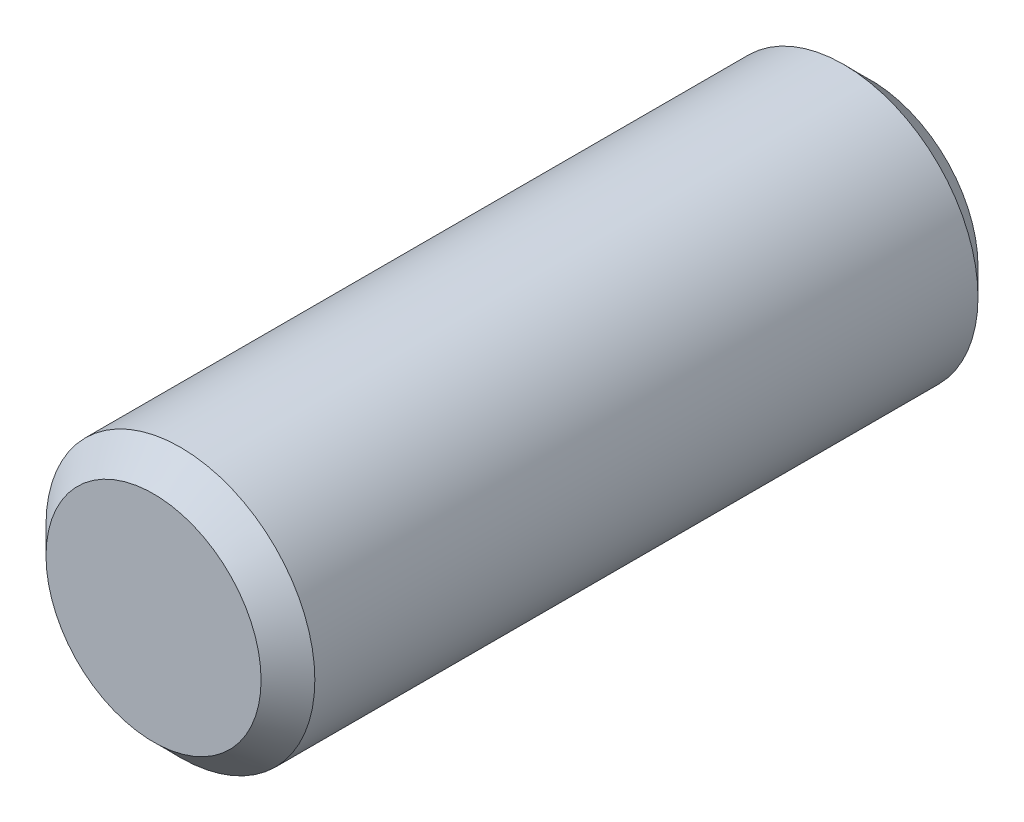
ISO-10303-21;
HEADER;
FILE_DESCRIPTION(('STEP AP214'),'2;1');
FILE_NAME('part.step','',(''),(''),'','','');
FILE_SCHEMA(('AUTOMOTIVE_DESIGN { 1 0 10303 214 1 1 1 1 }'));
ENDSEC;
DATA;
#1=APPLICATION_CONTEXT('core data for automotive mechanical design processes');
#2=APPLICATION_PROTOCOL_DEFINITION('international standard','automotive_design',2000,#1);
#3=PRODUCT_CONTEXT('',#1,'mechanical');
#4=PRODUCT('Part','Part','',(#3));
#5=PRODUCT_RELATED_PRODUCT_CATEGORY('part','',(#4));
#6=PRODUCT_DEFINITION_FORMATION('','',#4);
#7=PRODUCT_DEFINITION_CONTEXT('part definition',#1,'design');
#8=PRODUCT_DEFINITION('design','',#6,#7);
#9=PRODUCT_DEFINITION_SHAPE('','',#8);
#10=(LENGTH_UNIT() NAMED_UNIT(*) SI_UNIT(.MILLI.,.METRE.));
#11=(NAMED_UNIT(*) PLANE_ANGLE_UNIT() SI_UNIT($,.RADIAN.));
#12=(NAMED_UNIT(*) SI_UNIT($,.STERADIAN.) SOLID_ANGLE_UNIT());
#13=UNCERTAINTY_MEASURE_WITH_UNIT(LENGTH_MEASURE(1.E-05),#10,'distance_accuracy_value','');
#14=(GEOMETRIC_REPRESENTATION_CONTEXT(3) GLOBAL_UNCERTAINTY_ASSIGNED_CONTEXT((#13)) GLOBAL_UNIT_ASSIGNED_CONTEXT((#10,
#11,#12)) REPRESENTATION_CONTEXT('',''));
#15=CARTESIAN_POINT('',(0.,0.,0.));
#16=DIRECTION('',(0.,0.,1.));
#17=DIRECTION('',(1.,0.,0.));
#18=AXIS2_PLACEMENT_3D('',#15,#16,#17);
#19=CARTESIAN_POINT('',(0.,0.,8.));
#20=DIRECTION('',(0.,0.,-1.));
#21=DIRECTION('',(-1.,0.,0.));
#22=AXIS2_PLACEMENT_3D('',#19,#20,#21);
#23=CYLINDRICAL_SURFACE('',#22,1.5);
#24=CARTESIAN_POINT('',(0.,0.,0.3));
#25=DIRECTION('',(0.,0.,1.));
#26=DIRECTION('',(1.,0.,0.));
#27=AXIS2_PLACEMENT_3D('',#24,#25,#26);
#28=CIRCLE('',#27,1.5);
#29=CARTESIAN_POINT('',(1.5,0.,0.3));
#30=VERTEX_POINT('',#29);
#31=EDGE_CURVE('E43',#30,#30,#28,.T.);
#32=ORIENTED_EDGE('',*,*,#31,.T.);
#33=EDGE_LOOP('',(#32));
#34=FACE_BOUND('',#33,.T.);
#35=CARTESIAN_POINT('',(0.,0.,7.7));
#36=DIRECTION('',(0.,0.,1.));
#37=DIRECTION('',(1.,0.,0.));
#38=AXIS2_PLACEMENT_3D('',#35,#36,#37);
#39=CIRCLE('',#38,1.5);
#40=CARTESIAN_POINT('',(1.5,0.,7.7));
#41=VERTEX_POINT('',#40);
#42=EDGE_CURVE('E47',#41,#41,#39,.F.);
#43=ORIENTED_EDGE('',*,*,#42,.T.);
#44=EDGE_LOOP('',(#43));
#45=FACE_BOUND('',#44,.T.);
#46=ADVANCED_FACE('F32',(#34,#45),#23,.T.);
#47=CARTESIAN_POINT('',(0.,0.,8.));
#48=DIRECTION('',(0.,0.,1.));
#49=DIRECTION('',(1.,0.,0.));
#50=AXIS2_PLACEMENT_3D('',#47,#48,#49);
#51=PLANE('',#50);
#52=CARTESIAN_POINT('',(0.,0.,8.));
#53=DIRECTION('',(0.,0.,1.));
#54=DIRECTION('',(1.,0.,0.));
#55=AXIS2_PLACEMENT_3D('',#52,#53,#54);
#56=CIRCLE('',#55,1.2);
#57=CARTESIAN_POINT('',(1.2,0.,8.));
#58=VERTEX_POINT('',#57);
#59=EDGE_CURVE('E10',#58,#58,#56,.T.);
#60=ORIENTED_EDGE('',*,*,#59,.T.);
#61=EDGE_LOOP('',(#60));
#62=FACE_BOUND('',#61,.T.);
#63=ADVANCED_FACE('F63',(#62),#51,.T.);
#64=CARTESIAN_POINT('',(0.,0.,0.));
#65=DIRECTION('',(0.,0.,1.));
#66=DIRECTION('',(1.,0.,0.));
#67=AXIS2_PLACEMENT_3D('',#64,#65,#66);
#68=PLANE('',#67);
#69=CARTESIAN_POINT('',(0.,0.,0.));
#70=DIRECTION('',(0.,0.,1.));
#71=DIRECTION('',(1.,0.,0.));
#72=AXIS2_PLACEMENT_3D('',#69,#70,#71);
#73=CIRCLE('',#72,1.2);
#74=CARTESIAN_POINT('',(1.2,0.,0.));
#75=VERTEX_POINT('',#74);
#76=EDGE_CURVE('E39',#75,#75,#73,.F.);
#77=ORIENTED_EDGE('',*,*,#76,.T.);
#78=EDGE_LOOP('',(#77));
#79=FACE_BOUND('',#78,.T.);
#80=ADVANCED_FACE('F60',(#79),#68,.F.);
#81=CARTESIAN_POINT('',(0.,0.,0.3));
#82=DIRECTION('',(0.,0.,1.));
#83=DIRECTION('',(1.,0.,0.));
#84=AXIS2_PLACEMENT_3D('',#81,#82,#83);
#85=CONICAL_SURFACE('',#84,1.5,0.78539816339745);
#86=ORIENTED_EDGE('',*,*,#76,.F.);
#87=EDGE_LOOP('',(#86));
#88=FACE_BOUND('',#87,.T.);
#89=ORIENTED_EDGE('',*,*,#31,.F.);
#90=EDGE_LOOP('',(#89));
#91=FACE_BOUND('',#90,.T.);
#92=ADVANCED_FACE('F56',(#88,#91),#85,.T.);
#93=CARTESIAN_POINT('',(0.,0.,8.));
#94=DIRECTION('',(0.,0.,-1.));
#95=DIRECTION('',(-1.,0.,0.));
#96=AXIS2_PLACEMENT_3D('',#93,#94,#95);
#97=CONICAL_SURFACE('',#96,1.2,0.785398163397447);
#98=ORIENTED_EDGE('',*,*,#42,.F.);
#99=EDGE_LOOP('',(#98));
#100=FACE_BOUND('',#99,.T.);
#101=ORIENTED_EDGE('',*,*,#59,.F.);
#102=EDGE_LOOP('',(#101));
#103=FACE_BOUND('',#102,.T.);
#104=ADVANCED_FACE('F34',(#100,#103),#97,.T.);
#105=CLOSED_SHELL('',(#46,#63,#80,#92,#104));
#106=MANIFOLD_SOLID_BREP('B2',#105);
#107=ADVANCED_BREP_SHAPE_REPRESENTATION('',(#18,#106),#14);
#108=SHAPE_DEFINITION_REPRESENTATION(#9,#107);
ENDSEC;
END-ISO-10303-21;
